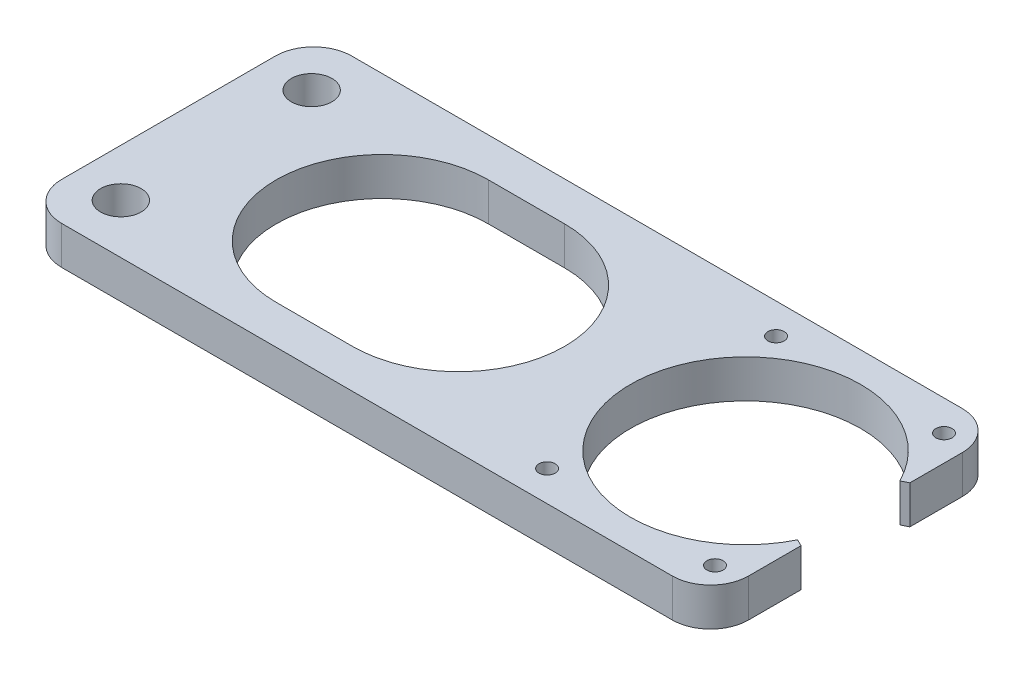
ISO-10303-21;
HEADER;
FILE_DESCRIPTION(('STEP AP214'),'2;1');
FILE_NAME('part.step','',(''),(''),'','','');
FILE_SCHEMA(('AUTOMOTIVE_DESIGN { 1 0 10303 214 1 1 1 1 }'));
ENDSEC;
DATA;
#1=APPLICATION_CONTEXT('core data for automotive mechanical design processes');
#2=APPLICATION_PROTOCOL_DEFINITION('international standard','automotive_design',2000,#1);
#3=PRODUCT_CONTEXT('',#1,'mechanical');
#4=PRODUCT('Part','Part','',(#3));
#5=PRODUCT_RELATED_PRODUCT_CATEGORY('part','',(#4));
#6=PRODUCT_DEFINITION_FORMATION('','',#4);
#7=PRODUCT_DEFINITION_CONTEXT('part definition',#1,'design');
#8=PRODUCT_DEFINITION('design','',#6,#7);
#9=PRODUCT_DEFINITION_SHAPE('','',#8);
#10=(LENGTH_UNIT() NAMED_UNIT(*) SI_UNIT(.MILLI.,.METRE.));
#11=(NAMED_UNIT(*) PLANE_ANGLE_UNIT() SI_UNIT($,.RADIAN.));
#12=(NAMED_UNIT(*) SI_UNIT($,.STERADIAN.) SOLID_ANGLE_UNIT());
#13=UNCERTAINTY_MEASURE_WITH_UNIT(LENGTH_MEASURE(1.E-05),#10,'distance_accuracy_value','');
#14=(GEOMETRIC_REPRESENTATION_CONTEXT(3) GLOBAL_UNCERTAINTY_ASSIGNED_CONTEXT((#13)) GLOBAL_UNIT_ASSIGNED_CONTEXT((#10,
#11,#12)) REPRESENTATION_CONTEXT('',''));
#15=CARTESIAN_POINT('',(0.,0.,0.));
#16=DIRECTION('',(0.,0.,1.));
#17=DIRECTION('',(1.,0.,0.));
#18=AXIS2_PLACEMENT_3D('',#15,#16,#17);
#19=CARTESIAN_POINT('',(96.012,6.35,-24.13));
#20=DIRECTION('',(0.,1.,0.));
#21=DIRECTION('',(0.,0.,1.));
#22=AXIS2_PLACEMENT_3D('',#19,#20,#21);
#23=PLANE('',#22);
#24=CARTESIAN_POINT('',(82.042,6.35,-43.18));
#25=DIRECTION('',(0.,1.,0.));
#26=DIRECTION('',(0.,0.,1.));
#27=AXIS2_PLACEMENT_3D('',#24,#25,#26);
#28=CIRCLE('',#27,1.35254999999998);
#29=CARTESIAN_POINT('',(82.042,6.35,-41.82745));
#30=VERTEX_POINT('',#29);
#31=EDGE_CURVE('E731',#30,#30,#28,.T.);
#32=ORIENTED_EDGE('',*,*,#31,.F.);
#33=EDGE_LOOP('',(#32));
#34=FACE_BOUND('',#33,.T.);
#35=CARTESIAN_POINT('',(109.982,6.35,-43.18));
#36=DIRECTION('',(0.,1.,0.));
#37=DIRECTION('',(0.,0.,1.));
#38=AXIS2_PLACEMENT_3D('',#35,#36,#37);
#39=CIRCLE('',#38,1.35254999999999);
#40=CARTESIAN_POINT('',(109.982,6.35,-41.82745));
#41=VERTEX_POINT('',#40);
#42=EDGE_CURVE('E723',#41,#41,#39,.T.);
#43=ORIENTED_EDGE('',*,*,#42,.F.);
#44=EDGE_LOOP('',(#43));
#45=FACE_BOUND('',#44,.T.);
#46=CARTESIAN_POINT('',(109.982,6.35,-5.08000000000001));
#47=DIRECTION('',(0.,1.,0.));
#48=DIRECTION('',(0.,0.,1.));
#49=AXIS2_PLACEMENT_3D('',#46,#47,#48);
#50=CIRCLE('',#49,1.35254999999999);
#51=CARTESIAN_POINT('',(109.982,6.35,-3.72745000000001));
#52=VERTEX_POINT('',#51);
#53=EDGE_CURVE('E710',#52,#52,#50,.T.);
#54=ORIENTED_EDGE('',*,*,#53,.F.);
#55=EDGE_LOOP('',(#54));
#56=FACE_BOUND('',#55,.T.);
#57=CARTESIAN_POINT('',(82.042,6.35,-5.08));
#58=DIRECTION('',(0.,1.,0.));
#59=DIRECTION('',(0.,0.,1.));
#60=AXIS2_PLACEMENT_3D('',#57,#58,#59);
#61=CIRCLE('',#60,1.35254999999998);
#62=CARTESIAN_POINT('',(82.042,6.35,-3.72745000000002));
#63=VERTEX_POINT('',#62);
#64=EDGE_CURVE('E694',#63,#63,#61,.T.);
#65=ORIENTED_EDGE('',*,*,#64,.F.);
#66=EDGE_LOOP('',(#65));
#67=FACE_BOUND('',#66,.T.);
#68=CARTESIAN_POINT('',(7.9375,6.35,-40.005));
#69=DIRECTION('',(0.,1.,0.));
#70=DIRECTION('',(0.,0.,1.));
#71=AXIS2_PLACEMENT_3D('',#68,#69,#70);
#72=CIRCLE('',#71,3.3782);
#73=CARTESIAN_POINT('',(7.9375,6.35,-36.6268));
#74=VERTEX_POINT('',#73);
#75=EDGE_CURVE('E685',#74,#74,#72,.T.);
#76=ORIENTED_EDGE('',*,*,#75,.F.);
#77=EDGE_LOOP('',(#76));
#78=FACE_BOUND('',#77,.T.);
#79=CARTESIAN_POINT('',(7.9375,6.35,-8.255));
#80=DIRECTION('',(0.,1.,0.));
#81=DIRECTION('',(0.,0.,1.));
#82=AXIS2_PLACEMENT_3D('',#79,#80,#81);
#83=CIRCLE('',#82,3.3782);
#84=CARTESIAN_POINT('',(7.9375,6.35,-4.8768));
#85=VERTEX_POINT('',#84);
#86=EDGE_CURVE('E690',#85,#85,#83,.T.);
#87=ORIENTED_EDGE('',*,*,#86,.F.);
#88=EDGE_LOOP('',(#87));
#89=FACE_BOUND('',#88,.T.);
#90=DIRECTION('',(0.,0.,-1.));
#91=VECTOR('',#90,1.);
#92=CARTESIAN_POINT('',(114.3,6.35,-33.184819128852));
#93=LINE('',#92,#91);
#94=CARTESIAN_POINT('',(114.3,6.35,-33.184819128852));
#95=VERTEX_POINT('',#94);
#96=CARTESIAN_POINT('',(114.3,6.35,-41.91));
#97=VERTEX_POINT('',#96);
#98=EDGE_CURVE('E302',#95,#97,#93,.T.);
#99=ORIENTED_EDGE('',*,*,#98,.T.);
#100=CARTESIAN_POINT('',(107.95,6.35,-41.91));
#101=DIRECTION('',(0.,1.,0.));
#102=DIRECTION('',(0.,0.,1.));
#103=AXIS2_PLACEMENT_3D('',#100,#101,#102);
#104=CIRCLE('',#103,6.35);
#105=CARTESIAN_POINT('',(107.95,6.35,-48.26));
#106=VERTEX_POINT('',#105);
#107=EDGE_CURVE('E385',#97,#106,#104,.T.);
#108=ORIENTED_EDGE('',*,*,#107,.T.);
#109=DIRECTION('',(1.,0.,0.));
#110=VECTOR('',#109,1.);
#111=CARTESIAN_POINT('',(0.,6.35,-48.26));
#112=LINE('',#111,#110);
#113=CARTESIAN_POINT('',(6.35,6.35,-48.26));
#114=VERTEX_POINT('',#113);
#115=EDGE_CURVE('E306',#114,#106,#112,.T.);
#116=ORIENTED_EDGE('',*,*,#115,.F.);
#117=CARTESIAN_POINT('',(6.35,6.35,-41.91));
#118=DIRECTION('',(0.,1.,0.));
#119=DIRECTION('',(0.,0.,1.));
#120=AXIS2_PLACEMENT_3D('',#117,#118,#119);
#121=CIRCLE('',#120,6.35);
#122=CARTESIAN_POINT('',(0.,6.35,-41.91));
#123=VERTEX_POINT('',#122);
#124=EDGE_CURVE('E98',#114,#123,#121,.T.);
#125=ORIENTED_EDGE('',*,*,#124,.T.);
#126=DIRECTION('',(0.,0.,-1.));
#127=VECTOR('',#126,1.);
#128=CARTESIAN_POINT('',(0.,6.35,0.));
#129=LINE('',#128,#127);
#130=CARTESIAN_POINT('',(0.,6.35,-6.35));
#131=VERTEX_POINT('',#130);
#132=EDGE_CURVE('E310',#131,#123,#129,.T.);
#133=ORIENTED_EDGE('',*,*,#132,.F.);
#134=CARTESIAN_POINT('',(6.35,6.35,-6.35));
#135=DIRECTION('',(0.,1.,0.));
#136=DIRECTION('',(0.,0.,1.));
#137=AXIS2_PLACEMENT_3D('',#134,#135,#136);
#138=CIRCLE('',#137,6.35);
#139=CARTESIAN_POINT('',(6.35,6.35,0.));
#140=VERTEX_POINT('',#139);
#141=EDGE_CURVE('E377',#131,#140,#138,.T.);
#142=ORIENTED_EDGE('',*,*,#141,.T.);
#143=DIRECTION('',(1.,0.,0.));
#144=VECTOR('',#143,1.);
#145=CARTESIAN_POINT('',(0.,6.35,0.));
#146=LINE('',#145,#144);
#147=CARTESIAN_POINT('',(107.95,6.35,0.));
#148=VERTEX_POINT('',#147);
#149=EDGE_CURVE('E284',#140,#148,#146,.T.);
#150=ORIENTED_EDGE('',*,*,#149,.T.);
#151=CARTESIAN_POINT('',(107.95,6.35,-6.35));
#152=DIRECTION('',(0.,1.,0.));
#153=DIRECTION('',(0.,0.,1.));
#154=AXIS2_PLACEMENT_3D('',#151,#152,#153);
#155=CIRCLE('',#154,6.35);
#156=CARTESIAN_POINT('',(114.3,6.35,-6.35));
#157=VERTEX_POINT('',#156);
#158=EDGE_CURVE('E380',#148,#157,#155,.T.);
#159=ORIENTED_EDGE('',*,*,#158,.T.);
#160=DIRECTION('',(0.,0.,-1.));
#161=VECTOR('',#160,1.);
#162=CARTESIAN_POINT('',(114.3,6.35,0.));
#163=LINE('',#162,#161);
#164=CARTESIAN_POINT('',(114.3,6.35,-15.0751808711479));
#165=VERTEX_POINT('',#164);
#166=EDGE_CURVE('E287',#157,#165,#163,.T.);
#167=ORIENTED_EDGE('',*,*,#166,.T.);
#168=DIRECTION('',(0.896168413341993,0.,0.443714068886817));
#169=VECTOR('',#168,1.);
#170=CARTESIAN_POINT('',(113.175058984961,6.35,-15.6321656383072));
#171=LINE('',#170,#169);
#172=CARTESIAN_POINT('',(113.175058984961,6.35,-15.6321656383073));
#173=VERTEX_POINT('',#172);
#174=EDGE_CURVE('E291',#173,#165,#171,.T.);
#175=ORIENTED_EDGE('',*,*,#174,.F.);
#176=CARTESIAN_POINT('',(96.012,6.35,-24.13));
#177=DIRECTION('',(0.,1.,0.));
#178=DIRECTION('',(0.,0.,1.));
#179=AXIS2_PLACEMENT_3D('',#176,#177,#178);
#180=CIRCLE('',#179,19.1516);
#181=CARTESIAN_POINT('',(113.175058984961,6.35,-32.6278343616928));
#182=VERTEX_POINT('',#181);
#183=EDGE_CURVE('E295',#182,#173,#180,.T.);
#184=ORIENTED_EDGE('',*,*,#183,.F.);
#185=DIRECTION('',(0.896168413342012,0.,-0.443714068886778));
#186=VECTOR('',#185,1.);
#187=CARTESIAN_POINT('',(113.175058984961,6.35,-32.6278343616928));
#188=LINE('',#187,#186);
#189=EDGE_CURVE('E299',#182,#95,#188,.T.);
#190=ORIENTED_EDGE('',*,*,#189,.T.);
#191=EDGE_LOOP('',(#99,#108,#116,#125,#133,#142,#150,#159,#167,#175,#184,#190));
#192=FACE_BOUND('',#191,.T.);
#193=DIRECTION('',(1.,0.,0.));
#194=VECTOR('',#193,1.);
#195=CARTESIAN_POINT('',(35.56,6.35,-6.477));
#196=LINE('',#195,#194);
#197=CARTESIAN_POINT('',(35.56,6.35,-6.477));
#198=VERTEX_POINT('',#197);
#199=CARTESIAN_POINT('',(48.26,6.35,-6.477));
#200=VERTEX_POINT('',#199);
#201=EDGE_CURVE('E238',#198,#200,#196,.T.);
#202=ORIENTED_EDGE('',*,*,#201,.F.);
#203=CARTESIAN_POINT('',(35.56,6.35,-24.13));
#204=DIRECTION('',(0.,1.,0.));
#205=DIRECTION('',(0.,0.,1.));
#206=AXIS2_PLACEMENT_3D('',#203,#204,#205);
#207=CIRCLE('',#206,17.653);
#208=CARTESIAN_POINT('',(35.56,6.35,-41.783));
#209=VERTEX_POINT('',#208);
#210=EDGE_CURVE('E226',#209,#198,#207,.T.);
#211=ORIENTED_EDGE('',*,*,#210,.F.);
#212=DIRECTION('',(1.,0.,0.));
#213=VECTOR('',#212,1.);
#214=CARTESIAN_POINT('',(35.56,6.35,-41.783));
#215=LINE('',#214,#213);
#216=CARTESIAN_POINT('',(48.26,6.35,-41.783));
#217=VERTEX_POINT('',#216);
#218=EDGE_CURVE('E258',#209,#217,#215,.T.);
#219=ORIENTED_EDGE('',*,*,#218,.T.);
#220=CARTESIAN_POINT('',(48.26,6.35,-24.13));
#221=DIRECTION('',(0.,1.,0.));
#222=DIRECTION('',(0.,0.,1.));
#223=AXIS2_PLACEMENT_3D('',#220,#221,#222);
#224=CIRCLE('',#223,17.653);
#225=EDGE_CURVE('E252',#200,#217,#224,.T.);
#226=ORIENTED_EDGE('',*,*,#225,.F.);
#227=EDGE_LOOP('',(#202,#211,#219,#226));
#228=FACE_BOUND('',#227,.T.);
#229=ADVANCED_FACE('F79',(#34,#45,#56,#67,#78,#89,#192,#228),#23,.T.);
#230=CARTESIAN_POINT('',(96.012,0.,-24.13));
#231=DIRECTION('',(0.,1.,0.));
#232=DIRECTION('',(0.,0.,1.));
#233=AXIS2_PLACEMENT_3D('',#230,#231,#232);
#234=PLANE('',#233);
#235=CARTESIAN_POINT('',(82.042,0.,-43.18));
#236=DIRECTION('',(0.,1.,0.));
#237=DIRECTION('',(0.,0.,1.));
#238=AXIS2_PLACEMENT_3D('',#235,#236,#237);
#239=CIRCLE('',#238,1.35254999999999);
#240=CARTESIAN_POINT('',(82.042,0.,-41.82745));
#241=VERTEX_POINT('',#240);
#242=EDGE_CURVE('E727',#241,#241,#239,.T.);
#243=ORIENTED_EDGE('',*,*,#242,.T.);
#244=EDGE_LOOP('',(#243));
#245=FACE_BOUND('',#244,.T.);
#246=CARTESIAN_POINT('',(109.982,0.,-43.18));
#247=DIRECTION('',(0.,1.,0.));
#248=DIRECTION('',(0.,0.,1.));
#249=AXIS2_PLACEMENT_3D('',#246,#247,#248);
#250=CIRCLE('',#249,1.35254999999999);
#251=CARTESIAN_POINT('',(109.982,0.,-41.82745));
#252=VERTEX_POINT('',#251);
#253=EDGE_CURVE('E714',#252,#252,#250,.T.);
#254=ORIENTED_EDGE('',*,*,#253,.T.);
#255=EDGE_LOOP('',(#254));
#256=FACE_BOUND('',#255,.T.);
#257=CARTESIAN_POINT('',(109.982,0.,-5.08000000000001));
#258=DIRECTION('',(0.,1.,0.));
#259=DIRECTION('',(0.,0.,1.));
#260=AXIS2_PLACEMENT_3D('',#257,#258,#259);
#261=CIRCLE('',#260,1.35254999999999);
#262=CARTESIAN_POINT('',(109.982,0.,-3.72745000000001));
#263=VERTEX_POINT('',#262);
#264=EDGE_CURVE('E708',#263,#263,#261,.T.);
#265=ORIENTED_EDGE('',*,*,#264,.T.);
#266=EDGE_LOOP('',(#265));
#267=FACE_BOUND('',#266,.T.);
#268=CARTESIAN_POINT('',(82.042,0.,-5.08));
#269=DIRECTION('',(0.,1.,0.));
#270=DIRECTION('',(0.,0.,1.));
#271=AXIS2_PLACEMENT_3D('',#268,#269,#270);
#272=CIRCLE('',#271,1.35254999999999);
#273=CARTESIAN_POINT('',(82.042,0.,-3.72745000000001));
#274=VERTEX_POINT('',#273);
#275=EDGE_CURVE('E687',#274,#274,#272,.T.);
#276=ORIENTED_EDGE('',*,*,#275,.T.);
#277=EDGE_LOOP('',(#276));
#278=FACE_BOUND('',#277,.T.);
#279=CARTESIAN_POINT('',(7.9375,0.,-40.005));
#280=DIRECTION('',(0.,1.,0.));
#281=DIRECTION('',(0.,0.,1.));
#282=AXIS2_PLACEMENT_3D('',#279,#280,#281);
#283=CIRCLE('',#282,3.3782);
#284=CARTESIAN_POINT('',(7.9375,0.,-36.6268));
#285=VERTEX_POINT('',#284);
#286=EDGE_CURVE('E682',#285,#285,#283,.T.);
#287=ORIENTED_EDGE('',*,*,#286,.T.);
#288=EDGE_LOOP('',(#287));
#289=FACE_BOUND('',#288,.T.);
#290=CARTESIAN_POINT('',(7.9375,0.,-8.255));
#291=DIRECTION('',(0.,1.,0.));
#292=DIRECTION('',(0.,0.,1.));
#293=AXIS2_PLACEMENT_3D('',#290,#291,#292);
#294=CIRCLE('',#293,3.3782);
#295=CARTESIAN_POINT('',(7.9375,0.,-4.8768));
#296=VERTEX_POINT('',#295);
#297=EDGE_CURVE('E267',#296,#296,#294,.T.);
#298=ORIENTED_EDGE('',*,*,#297,.T.);
#299=EDGE_LOOP('',(#298));
#300=FACE_BOUND('',#299,.T.);
#301=DIRECTION('',(1.,0.,0.));
#302=VECTOR('',#301,1.);
#303=CARTESIAN_POINT('',(0.,0.,-48.26));
#304=LINE('',#303,#302);
#305=CARTESIAN_POINT('',(6.35,0.,-48.26));
#306=VERTEX_POINT('',#305);
#307=CARTESIAN_POINT('',(107.95,0.,-48.26));
#308=VERTEX_POINT('',#307);
#309=EDGE_CURVE('E335',#306,#308,#304,.T.);
#310=ORIENTED_EDGE('',*,*,#309,.T.);
#311=CARTESIAN_POINT('',(107.95,0.,-41.91));
#312=DIRECTION('',(0.,1.,0.));
#313=DIRECTION('',(0.,0.,1.));
#314=AXIS2_PLACEMENT_3D('',#311,#312,#313);
#315=CIRCLE('',#314,6.35);
#316=CARTESIAN_POINT('',(114.3,0.,-41.91));
#317=VERTEX_POINT('',#316);
#318=EDGE_CURVE('E371',#308,#317,#315,.F.);
#319=ORIENTED_EDGE('',*,*,#318,.T.);
#320=DIRECTION('',(0.,0.,-1.));
#321=VECTOR('',#320,1.);
#322=CARTESIAN_POINT('',(114.3,0.,-33.184819128852));
#323=LINE('',#322,#321);
#324=CARTESIAN_POINT('',(114.3,0.,-33.184819128852));
#325=VERTEX_POINT('',#324);
#326=EDGE_CURVE('E331',#325,#317,#323,.T.);
#327=ORIENTED_EDGE('',*,*,#326,.F.);
#328=DIRECTION('',(0.896168413342012,0.,-0.443714068886778));
#329=VECTOR('',#328,1.);
#330=CARTESIAN_POINT('',(113.175058984961,0.,-32.6278343616928));
#331=LINE('',#330,#329);
#332=CARTESIAN_POINT('',(113.175058984961,0.,-32.6278343616928));
#333=VERTEX_POINT('',#332);
#334=EDGE_CURVE('E328',#333,#325,#331,.T.);
#335=ORIENTED_EDGE('',*,*,#334,.F.);
#336=CARTESIAN_POINT('',(96.012,0.,-24.13));
#337=DIRECTION('',(0.,1.,0.));
#338=DIRECTION('',(0.,0.,1.));
#339=AXIS2_PLACEMENT_3D('',#336,#337,#338);
#340=CIRCLE('',#339,19.1516);
#341=CARTESIAN_POINT('',(113.175058984961,0.,-15.6321656383073));
#342=VERTEX_POINT('',#341);
#343=EDGE_CURVE('E324',#333,#342,#340,.T.);
#344=ORIENTED_EDGE('',*,*,#343,.T.);
#345=DIRECTION('',(0.896168413341993,0.,0.443714068886817));
#346=VECTOR('',#345,1.);
#347=CARTESIAN_POINT('',(113.175058984961,0.,-15.6321656383072));
#348=LINE('',#347,#346);
#349=CARTESIAN_POINT('',(114.3,0.,-15.0751808711479));
#350=VERTEX_POINT('',#349);
#351=EDGE_CURVE('E320',#342,#350,#348,.T.);
#352=ORIENTED_EDGE('',*,*,#351,.T.);
#353=DIRECTION('',(0.,0.,-1.));
#354=VECTOR('',#353,1.);
#355=CARTESIAN_POINT('',(114.3,0.,0.));
#356=LINE('',#355,#354);
#357=CARTESIAN_POINT('',(114.3,0.,-6.35));
#358=VERTEX_POINT('',#357);
#359=EDGE_CURVE('E317',#358,#350,#356,.T.);
#360=ORIENTED_EDGE('',*,*,#359,.F.);
#361=CARTESIAN_POINT('',(107.95,0.,-6.35));
#362=DIRECTION('',(0.,1.,0.));
#363=DIRECTION('',(0.,0.,1.));
#364=AXIS2_PLACEMENT_3D('',#361,#362,#363);
#365=CIRCLE('',#364,6.35);
#366=CARTESIAN_POINT('',(107.95,0.,0.));
#367=VERTEX_POINT('',#366);
#368=EDGE_CURVE('E365',#358,#367,#365,.F.);
#369=ORIENTED_EDGE('',*,*,#368,.T.);
#370=DIRECTION('',(1.,0.,0.));
#371=VECTOR('',#370,1.);
#372=CARTESIAN_POINT('',(0.,0.,0.));
#373=LINE('',#372,#371);
#374=CARTESIAN_POINT('',(6.35,0.,0.));
#375=VERTEX_POINT('',#374);
#376=EDGE_CURVE('E247',#375,#367,#373,.T.);
#377=ORIENTED_EDGE('',*,*,#376,.F.);
#378=CARTESIAN_POINT('',(6.35,0.,-6.35));
#379=DIRECTION('',(0.,1.,0.));
#380=DIRECTION('',(0.,0.,1.));
#381=AXIS2_PLACEMENT_3D('',#378,#379,#380);
#382=CIRCLE('',#381,6.35);
#383=CARTESIAN_POINT('',(0.,0.,-6.35));
#384=VERTEX_POINT('',#383);
#385=EDGE_CURVE('E362',#375,#384,#382,.F.);
#386=ORIENTED_EDGE('',*,*,#385,.T.);
#387=DIRECTION('',(0.,0.,-1.));
#388=VECTOR('',#387,1.);
#389=CARTESIAN_POINT('',(0.,0.,0.));
#390=LINE('',#389,#388);
#391=CARTESIAN_POINT('',(0.,0.,-41.91));
#392=VERTEX_POINT('',#391);
#393=EDGE_CURVE('E288',#384,#392,#390,.T.);
#394=ORIENTED_EDGE('',*,*,#393,.T.);
#395=CARTESIAN_POINT('',(6.35,0.,-41.91));
#396=DIRECTION('',(0.,1.,0.));
#397=DIRECTION('',(0.,0.,1.));
#398=AXIS2_PLACEMENT_3D('',#395,#396,#397);
#399=CIRCLE('',#398,6.35);
#400=EDGE_CURVE('E368',#392,#306,#399,.F.);
#401=ORIENTED_EDGE('',*,*,#400,.T.);
#402=EDGE_LOOP('',(#310,#319,#327,#335,#344,#352,#360,#369,#377,#386,#394,#401));
#403=FACE_BOUND('',#402,.T.);
#404=CARTESIAN_POINT('',(35.56,0.,-24.13));
#405=DIRECTION('',(0.,1.,0.));
#406=DIRECTION('',(0.,0.,1.));
#407=AXIS2_PLACEMENT_3D('',#404,#405,#406);
#408=CIRCLE('',#407,17.653);
#409=CARTESIAN_POINT('',(35.56,0.,-41.783));
#410=VERTEX_POINT('',#409);
#411=CARTESIAN_POINT('',(35.56,0.,-6.477));
#412=VERTEX_POINT('',#411);
#413=EDGE_CURVE('E264',#410,#412,#408,.T.);
#414=ORIENTED_EDGE('',*,*,#413,.T.);
#415=DIRECTION('',(1.,0.,0.));
#416=VECTOR('',#415,1.);
#417=CARTESIAN_POINT('',(35.56,0.,-6.477));
#418=LINE('',#417,#416);
#419=CARTESIAN_POINT('',(48.26,0.,-6.477));
#420=VERTEX_POINT('',#419);
#421=EDGE_CURVE('E245',#412,#420,#418,.T.);
#422=ORIENTED_EDGE('',*,*,#421,.T.);
#423=CARTESIAN_POINT('',(48.26,0.,-24.13));
#424=DIRECTION('',(0.,1.,0.));
#425=DIRECTION('',(0.,0.,1.));
#426=AXIS2_PLACEMENT_3D('',#423,#424,#425);
#427=CIRCLE('',#426,17.653);
#428=CARTESIAN_POINT('',(48.26,0.,-41.783));
#429=VERTEX_POINT('',#428);
#430=EDGE_CURVE('E270',#420,#429,#427,.T.);
#431=ORIENTED_EDGE('',*,*,#430,.T.);
#432=DIRECTION('',(1.,0.,0.));
#433=VECTOR('',#432,1.);
#434=CARTESIAN_POINT('',(35.56,0.,-41.783));
#435=LINE('',#434,#433);
#436=EDGE_CURVE('E239',#410,#429,#435,.T.);
#437=ORIENTED_EDGE('',*,*,#436,.F.);
#438=EDGE_LOOP('',(#414,#422,#431,#437));
#439=FACE_BOUND('',#438,.T.);
#440=ADVANCED_FACE('F409',(#245,#256,#267,#278,#289,#300,#403,#439),#234,.F.);
#441=CARTESIAN_POINT('',(0.,6.35,0.));
#442=DIRECTION('',(0.,0.,-1.));
#443=DIRECTION('',(-1.,0.,0.));
#444=AXIS2_PLACEMENT_3D('',#441,#442,#443);
#445=PLANE('',#444);
#446=ORIENTED_EDGE('',*,*,#376,.T.);
#447=DIRECTION('',(0.,-1.,0.));
#448=VECTOR('',#447,1.);
#449=CARTESIAN_POINT('',(107.95,6.35,0.));
#450=LINE('',#449,#448);
#451=EDGE_CURVE('E12',#367,#148,#450,.F.);
#452=ORIENTED_EDGE('',*,*,#451,.T.);
#453=ORIENTED_EDGE('',*,*,#149,.F.);
#454=DIRECTION('',(0.,-1.,0.));
#455=VECTOR('',#454,1.);
#456=CARTESIAN_POINT('',(6.35,0.,0.));
#457=LINE('',#456,#455);
#458=EDGE_CURVE('E88',#140,#375,#457,.T.);
#459=ORIENTED_EDGE('',*,*,#458,.T.);
#460=EDGE_LOOP('',(#446,#452,#453,#459));
#461=FACE_BOUND('',#460,.T.);
#462=ADVANCED_FACE('F404',(#461),#445,.F.);
#463=CARTESIAN_POINT('',(114.3,6.35,0.));
#464=DIRECTION('',(-1.,0.,0.));
#465=DIRECTION('',(0.,0.,1.));
#466=AXIS2_PLACEMENT_3D('',#463,#464,#465);
#467=PLANE('',#466);
#468=ORIENTED_EDGE('',*,*,#166,.F.);
#469=DIRECTION('',(0.,-1.,0.));
#470=VECTOR('',#469,1.);
#471=CARTESIAN_POINT('',(114.3,6.35,-6.35));
#472=LINE('',#471,#470);
#473=EDGE_CURVE('E394',#157,#358,#472,.T.);
#474=ORIENTED_EDGE('',*,*,#473,.T.);
#475=ORIENTED_EDGE('',*,*,#359,.T.);
#476=DIRECTION('',(0.,-1.,0.));
#477=VECTOR('',#476,1.);
#478=CARTESIAN_POINT('',(114.3,6.35,-15.0751808711479));
#479=LINE('',#478,#477);
#480=EDGE_CURVE('E351',#165,#350,#479,.T.);
#481=ORIENTED_EDGE('',*,*,#480,.F.);
#482=EDGE_LOOP('',(#468,#474,#475,#481));
#483=FACE_BOUND('',#482,.T.);
#484=ADVANCED_FACE('F418',(#483),#467,.F.);
#485=CARTESIAN_POINT('',(113.175058984961,6.35,-15.6321656383072));
#486=DIRECTION('',(0.443714068886817,0.,-0.896168413341993));
#487=DIRECTION('',(-0.896168413341993,0.,-0.443714068886817));
#488=AXIS2_PLACEMENT_3D('',#485,#486,#487);
#489=PLANE('',#488);
#490=ORIENTED_EDGE('',*,*,#351,.F.);
#491=DIRECTION('',(0.,-1.,0.));
#492=VECTOR('',#491,1.);
#493=CARTESIAN_POINT('',(113.175058984961,6.35,-15.6321656383073));
#494=LINE('',#493,#492);
#495=EDGE_CURVE('E348',#173,#342,#494,.T.);
#496=ORIENTED_EDGE('',*,*,#495,.F.);
#497=ORIENTED_EDGE('',*,*,#174,.T.);
#498=ORIENTED_EDGE('',*,*,#480,.T.);
#499=EDGE_LOOP('',(#490,#496,#497,#498));
#500=FACE_BOUND('',#499,.T.);
#501=ADVANCED_FACE('F463',(#500),#489,.T.);
#502=CARTESIAN_POINT('',(96.012,6.35,-24.13));
#503=DIRECTION('',(0.,-1.,0.));
#504=DIRECTION('',(0.,0.,-1.));
#505=AXIS2_PLACEMENT_3D('',#502,#503,#504);
#506=CYLINDRICAL_SURFACE('',#505,19.1516);
#507=ORIENTED_EDGE('',*,*,#343,.F.);
#508=DIRECTION('',(0.,-1.,0.));
#509=VECTOR('',#508,1.);
#510=CARTESIAN_POINT('',(113.175058984961,6.35,-32.6278343616928));
#511=LINE('',#510,#509);
#512=EDGE_CURVE('E345',#182,#333,#511,.T.);
#513=ORIENTED_EDGE('',*,*,#512,.F.);
#514=ORIENTED_EDGE('',*,*,#183,.T.);
#515=ORIENTED_EDGE('',*,*,#495,.T.);
#516=EDGE_LOOP('',(#507,#513,#514,#515));
#517=FACE_BOUND('',#516,.T.);
#518=ADVANCED_FACE('F459',(#517),#506,.F.);
#519=CARTESIAN_POINT('',(113.175058984961,6.35,-32.6278343616928));
#520=DIRECTION('',(-0.443714068886778,0.,-0.896168413342012));
#521=DIRECTION('',(-0.896168413342012,0.,0.443714068886778));
#522=AXIS2_PLACEMENT_3D('',#519,#520,#521);
#523=PLANE('',#522);
#524=ORIENTED_EDGE('',*,*,#334,.T.);
#525=DIRECTION('',(0.,-1.,0.));
#526=VECTOR('',#525,1.);
#527=CARTESIAN_POINT('',(114.3,6.35,-33.184819128852));
#528=LINE('',#527,#526);
#529=EDGE_CURVE('E313',#95,#325,#528,.T.);
#530=ORIENTED_EDGE('',*,*,#529,.F.);
#531=ORIENTED_EDGE('',*,*,#189,.F.);
#532=ORIENTED_EDGE('',*,*,#512,.T.);
#533=EDGE_LOOP('',(#524,#530,#531,#532));
#534=FACE_BOUND('',#533,.T.);
#535=ADVANCED_FACE('F455',(#534),#523,.F.);
#536=CARTESIAN_POINT('',(114.3,6.35,-33.184819128852));
#537=DIRECTION('',(-1.,0.,0.));
#538=DIRECTION('',(0.,0.,1.));
#539=AXIS2_PLACEMENT_3D('',#536,#537,#538);
#540=PLANE('',#539);
#541=ORIENTED_EDGE('',*,*,#326,.T.);
#542=DIRECTION('',(0.,-1.,0.));
#543=VECTOR('',#542,1.);
#544=CARTESIAN_POINT('',(114.3,6.35,-41.91));
#545=LINE('',#544,#543);
#546=EDGE_CURVE('E374',#317,#97,#545,.F.);
#547=ORIENTED_EDGE('',*,*,#546,.T.);
#548=ORIENTED_EDGE('',*,*,#98,.F.);
#549=ORIENTED_EDGE('',*,*,#529,.T.);
#550=EDGE_LOOP('',(#541,#547,#548,#549));
#551=FACE_BOUND('',#550,.T.);
#552=ADVANCED_FACE('F451',(#551),#540,.F.);
#553=CARTESIAN_POINT('',(0.,6.35,-48.26));
#554=DIRECTION('',(0.,0.,-1.));
#555=DIRECTION('',(-1.,0.,0.));
#556=AXIS2_PLACEMENT_3D('',#553,#554,#555);
#557=PLANE('',#556);
#558=ORIENTED_EDGE('',*,*,#115,.T.);
#559=DIRECTION('',(0.,-1.,0.));
#560=VECTOR('',#559,1.);
#561=CARTESIAN_POINT('',(107.95,0.,-48.26));
#562=LINE('',#561,#560);
#563=EDGE_CURVE('E358',#106,#308,#562,.T.);
#564=ORIENTED_EDGE('',*,*,#563,.T.);
#565=ORIENTED_EDGE('',*,*,#309,.F.);
#566=DIRECTION('',(0.,-1.,0.));
#567=VECTOR('',#566,1.);
#568=CARTESIAN_POINT('',(6.35,6.35,-48.26));
#569=LINE('',#568,#567);
#570=EDGE_CURVE('E355',#306,#114,#569,.F.);
#571=ORIENTED_EDGE('',*,*,#570,.T.);
#572=EDGE_LOOP('',(#558,#564,#565,#571));
#573=FACE_BOUND('',#572,.T.);
#574=ADVANCED_FACE('F448',(#573),#557,.T.);
#575=CARTESIAN_POINT('',(0.,6.35,0.));
#576=DIRECTION('',(-1.,0.,0.));
#577=DIRECTION('',(0.,0.,1.));
#578=AXIS2_PLACEMENT_3D('',#575,#576,#577);
#579=PLANE('',#578);
#580=ORIENTED_EDGE('',*,*,#132,.T.);
#581=DIRECTION('',(0.,-1.,0.));
#582=VECTOR('',#581,1.);
#583=CARTESIAN_POINT('',(0.,6.35,-41.91));
#584=LINE('',#583,#582);
#585=EDGE_CURVE('E390',#123,#392,#584,.T.);
#586=ORIENTED_EDGE('',*,*,#585,.T.);
#587=ORIENTED_EDGE('',*,*,#393,.F.);
#588=DIRECTION('',(0.,-1.,0.));
#589=VECTOR('',#588,1.);
#590=CARTESIAN_POINT('',(0.,6.35,-6.35));
#591=LINE('',#590,#589);
#592=EDGE_CURVE('E108',#384,#131,#591,.F.);
#593=ORIENTED_EDGE('',*,*,#592,.T.);
#594=EDGE_LOOP('',(#580,#586,#587,#593));
#595=FACE_BOUND('',#594,.T.);
#596=ADVANCED_FACE('F445',(#595),#579,.T.);
#597=CARTESIAN_POINT('',(35.56,6.35,-24.13));
#598=DIRECTION('',(0.,-1.,0.));
#599=DIRECTION('',(0.,0.,-1.));
#600=AXIS2_PLACEMENT_3D('',#597,#598,#599);
#601=CYLINDRICAL_SURFACE('',#600,17.653);
#602=ORIENTED_EDGE('',*,*,#413,.F.);
#603=DIRECTION('',(0.,-1.,0.));
#604=VECTOR('',#603,1.);
#605=CARTESIAN_POINT('',(35.56,6.35,-41.783));
#606=LINE('',#605,#604);
#607=EDGE_CURVE('E232',#209,#410,#606,.T.);
#608=ORIENTED_EDGE('',*,*,#607,.F.);
#609=ORIENTED_EDGE('',*,*,#210,.T.);
#610=DIRECTION('',(0.,-1.,0.));
#611=VECTOR('',#610,1.);
#612=CARTESIAN_POINT('',(35.56,6.35,-6.477));
#613=LINE('',#612,#611);
#614=EDGE_CURVE('E229',#198,#412,#613,.T.);
#615=ORIENTED_EDGE('',*,*,#614,.T.);
#616=EDGE_LOOP('',(#602,#608,#609,#615));
#617=FACE_BOUND('',#616,.T.);
#618=ADVANCED_FACE('F228',(#617),#601,.F.);
#619=CARTESIAN_POINT('',(35.56,6.35,-6.477));
#620=DIRECTION('',(0.,0.,-1.));
#621=DIRECTION('',(-1.,0.,0.));
#622=AXIS2_PLACEMENT_3D('',#619,#620,#621);
#623=PLANE('',#622);
#624=ORIENTED_EDGE('',*,*,#421,.F.);
#625=ORIENTED_EDGE('',*,*,#614,.F.);
#626=ORIENTED_EDGE('',*,*,#201,.T.);
#627=DIRECTION('',(0.,-1.,0.));
#628=VECTOR('',#627,1.);
#629=CARTESIAN_POINT('',(48.26,6.35,-6.477));
#630=LINE('',#629,#628);
#631=EDGE_CURVE('E248',#200,#420,#630,.T.);
#632=ORIENTED_EDGE('',*,*,#631,.T.);
#633=EDGE_LOOP('',(#624,#625,#626,#632));
#634=FACE_BOUND('',#633,.T.);
#635=ADVANCED_FACE('F242',(#634),#623,.T.);
#636=CARTESIAN_POINT('',(48.26,6.35,-24.13));
#637=DIRECTION('',(0.,-1.,0.));
#638=DIRECTION('',(0.,0.,-1.));
#639=AXIS2_PLACEMENT_3D('',#636,#637,#638);
#640=CYLINDRICAL_SURFACE('',#639,17.653);
#641=ORIENTED_EDGE('',*,*,#430,.F.);
#642=ORIENTED_EDGE('',*,*,#631,.F.);
#643=ORIENTED_EDGE('',*,*,#225,.T.);
#644=DIRECTION('',(0.,-1.,0.));
#645=VECTOR('',#644,1.);
#646=CARTESIAN_POINT('',(48.26,6.35,-41.783));
#647=LINE('',#646,#645);
#648=EDGE_CURVE('E279',#217,#429,#647,.T.);
#649=ORIENTED_EDGE('',*,*,#648,.T.);
#650=EDGE_LOOP('',(#641,#642,#643,#649));
#651=FACE_BOUND('',#650,.T.);
#652=ADVANCED_FACE('F598',(#651),#640,.F.);
#653=CARTESIAN_POINT('',(35.56,6.35,-41.783));
#654=DIRECTION('',(0.,0.,-1.));
#655=DIRECTION('',(-1.,0.,0.));
#656=AXIS2_PLACEMENT_3D('',#653,#654,#655);
#657=PLANE('',#656);
#658=ORIENTED_EDGE('',*,*,#436,.T.);
#659=ORIENTED_EDGE('',*,*,#648,.F.);
#660=ORIENTED_EDGE('',*,*,#218,.F.);
#661=ORIENTED_EDGE('',*,*,#607,.T.);
#662=EDGE_LOOP('',(#658,#659,#660,#661));
#663=FACE_BOUND('',#662,.T.);
#664=ADVANCED_FACE('F475',(#663),#657,.F.);
#665=CARTESIAN_POINT('',(107.95,6.35,-41.91));
#666=DIRECTION('',(0.,1.,0.));
#667=DIRECTION('',(0.,0.,1.));
#668=AXIS2_PLACEMENT_3D('',#665,#666,#667);
#669=CYLINDRICAL_SURFACE('',#668,6.35);
#670=ORIENTED_EDGE('',*,*,#107,.F.);
#671=ORIENTED_EDGE('',*,*,#546,.F.);
#672=ORIENTED_EDGE('',*,*,#318,.F.);
#673=ORIENTED_EDGE('',*,*,#563,.F.);
#674=EDGE_LOOP('',(#670,#671,#672,#673));
#675=FACE_BOUND('',#674,.T.);
#676=ADVANCED_FACE('F472',(#675),#669,.T.);
#677=CARTESIAN_POINT('',(6.35,6.35,-41.91));
#678=DIRECTION('',(0.,-1.,0.));
#679=DIRECTION('',(0.,0.,-1.));
#680=AXIS2_PLACEMENT_3D('',#677,#678,#679);
#681=CYLINDRICAL_SURFACE('',#680,6.35);
#682=ORIENTED_EDGE('',*,*,#124,.F.);
#683=ORIENTED_EDGE('',*,*,#570,.F.);
#684=ORIENTED_EDGE('',*,*,#400,.F.);
#685=ORIENTED_EDGE('',*,*,#585,.F.);
#686=EDGE_LOOP('',(#682,#683,#684,#685));
#687=FACE_BOUND('',#686,.T.);
#688=ADVANCED_FACE('F431',(#687),#681,.T.);
#689=CARTESIAN_POINT('',(107.95,6.35,-6.35));
#690=DIRECTION('',(0.,-1.,0.));
#691=DIRECTION('',(0.,0.,-1.));
#692=AXIS2_PLACEMENT_3D('',#689,#690,#691);
#693=CYLINDRICAL_SURFACE('',#692,6.35);
#694=ORIENTED_EDGE('',*,*,#158,.F.);
#695=ORIENTED_EDGE('',*,*,#451,.F.);
#696=ORIENTED_EDGE('',*,*,#368,.F.);
#697=ORIENTED_EDGE('',*,*,#473,.F.);
#698=EDGE_LOOP('',(#694,#695,#696,#697));
#699=FACE_BOUND('',#698,.T.);
#700=ADVANCED_FACE('F415',(#699),#693,.T.);
#701=CARTESIAN_POINT('',(6.35,6.35,-6.35));
#702=DIRECTION('',(0.,1.,0.));
#703=DIRECTION('',(0.,0.,1.));
#704=AXIS2_PLACEMENT_3D('',#701,#702,#703);
#705=CYLINDRICAL_SURFACE('',#704,6.35);
#706=ORIENTED_EDGE('',*,*,#141,.F.);
#707=ORIENTED_EDGE('',*,*,#592,.F.);
#708=ORIENTED_EDGE('',*,*,#385,.F.);
#709=ORIENTED_EDGE('',*,*,#458,.F.);
#710=EDGE_LOOP('',(#706,#707,#708,#709));
#711=FACE_BOUND('',#710,.T.);
#712=ADVANCED_FACE('F81',(#711),#705,.T.);
#713=CARTESIAN_POINT('',(7.9375,6.35,-8.255));
#714=DIRECTION('',(0.,1.,0.));
#715=DIRECTION('',(0.,0.,1.));
#716=AXIS2_PLACEMENT_3D('',#713,#714,#715);
#717=CYLINDRICAL_SURFACE('',#716,3.3782);
#718=ORIENTED_EDGE('',*,*,#297,.F.);
#719=EDGE_LOOP('',(#718));
#720=FACE_BOUND('',#719,.T.);
#721=ORIENTED_EDGE('',*,*,#86,.T.);
#722=EDGE_LOOP('',(#721));
#723=FACE_BOUND('',#722,.T.);
#724=ADVANCED_FACE('F423',(#720,#723),#717,.F.);
#725=CARTESIAN_POINT('',(7.9375,6.35,-40.005));
#726=DIRECTION('',(0.,1.,0.));
#727=DIRECTION('',(0.,0.,1.));
#728=AXIS2_PLACEMENT_3D('',#725,#726,#727);
#729=CYLINDRICAL_SURFACE('',#728,3.3782);
#730=ORIENTED_EDGE('',*,*,#286,.F.);
#731=EDGE_LOOP('',(#730));
#732=FACE_BOUND('',#731,.T.);
#733=ORIENTED_EDGE('',*,*,#75,.T.);
#734=EDGE_LOOP('',(#733));
#735=FACE_BOUND('',#734,.T.);
#736=ADVANCED_FACE('F428',(#732,#735),#729,.F.);
#737=CARTESIAN_POINT('',(82.042,6.35,-5.08));
#738=DIRECTION('',(0.,1.,0.));
#739=DIRECTION('',(0.,0.,1.));
#740=AXIS2_PLACEMENT_3D('',#737,#738,#739);
#741=CYLINDRICAL_SURFACE('',#740,1.35254999999999);
#742=ORIENTED_EDGE('',*,*,#275,.F.);
#743=EDGE_LOOP('',(#742));
#744=FACE_BOUND('',#743,.T.);
#745=ORIENTED_EDGE('',*,*,#64,.T.);
#746=EDGE_LOOP('',(#745));
#747=FACE_BOUND('',#746,.T.);
#748=ADVANCED_FACE('F550',(#744,#747),#741,.F.);
#749=CARTESIAN_POINT('',(109.982,6.35,-5.08000000000001));
#750=DIRECTION('',(0.,1.,0.));
#751=DIRECTION('',(0.,0.,1.));
#752=AXIS2_PLACEMENT_3D('',#749,#750,#751);
#753=CYLINDRICAL_SURFACE('',#752,1.35254999999999);
#754=ORIENTED_EDGE('',*,*,#264,.F.);
#755=EDGE_LOOP('',(#754));
#756=FACE_BOUND('',#755,.T.);
#757=ORIENTED_EDGE('',*,*,#53,.T.);
#758=EDGE_LOOP('',(#757));
#759=FACE_BOUND('',#758,.T.);
#760=ADVANCED_FACE('F537',(#756,#759),#753,.F.);
#761=CARTESIAN_POINT('',(109.982,6.35,-43.18));
#762=DIRECTION('',(0.,1.,0.));
#763=DIRECTION('',(0.,0.,1.));
#764=AXIS2_PLACEMENT_3D('',#761,#762,#763);
#765=CYLINDRICAL_SURFACE('',#764,1.35254999999999);
#766=ORIENTED_EDGE('',*,*,#253,.F.);
#767=EDGE_LOOP('',(#766));
#768=FACE_BOUND('',#767,.T.);
#769=ORIENTED_EDGE('',*,*,#42,.T.);
#770=EDGE_LOOP('',(#769));
#771=FACE_BOUND('',#770,.T.);
#772=ADVANCED_FACE('F533',(#768,#771),#765,.F.);
#773=CARTESIAN_POINT('',(82.042,6.35,-43.18));
#774=DIRECTION('',(0.,1.,0.));
#775=DIRECTION('',(0.,0.,1.));
#776=AXIS2_PLACEMENT_3D('',#773,#774,#775);
#777=CYLINDRICAL_SURFACE('',#776,1.35254999999999);
#778=ORIENTED_EDGE('',*,*,#242,.F.);
#779=EDGE_LOOP('',(#778));
#780=FACE_BOUND('',#779,.T.);
#781=ORIENTED_EDGE('',*,*,#31,.T.);
#782=EDGE_LOOP('',(#781));
#783=FACE_BOUND('',#782,.T.);
#784=ADVANCED_FACE('F536',(#780,#783),#777,.F.);
#785=CLOSED_SHELL('',(#229,#440,#462,#484,#501,#518,#535,#552,#574,#596,#618,#635,#652,#664,
#676,#688,#700,#712,#724,#736,#748,#760,#772,#784));
#786=MANIFOLD_SOLID_BREP('B2',#785);
#787=ADVANCED_BREP_SHAPE_REPRESENTATION('',(#18,#786),#14);
#788=SHAPE_DEFINITION_REPRESENTATION(#9,#787);
ENDSEC;
END-ISO-10303-21;
